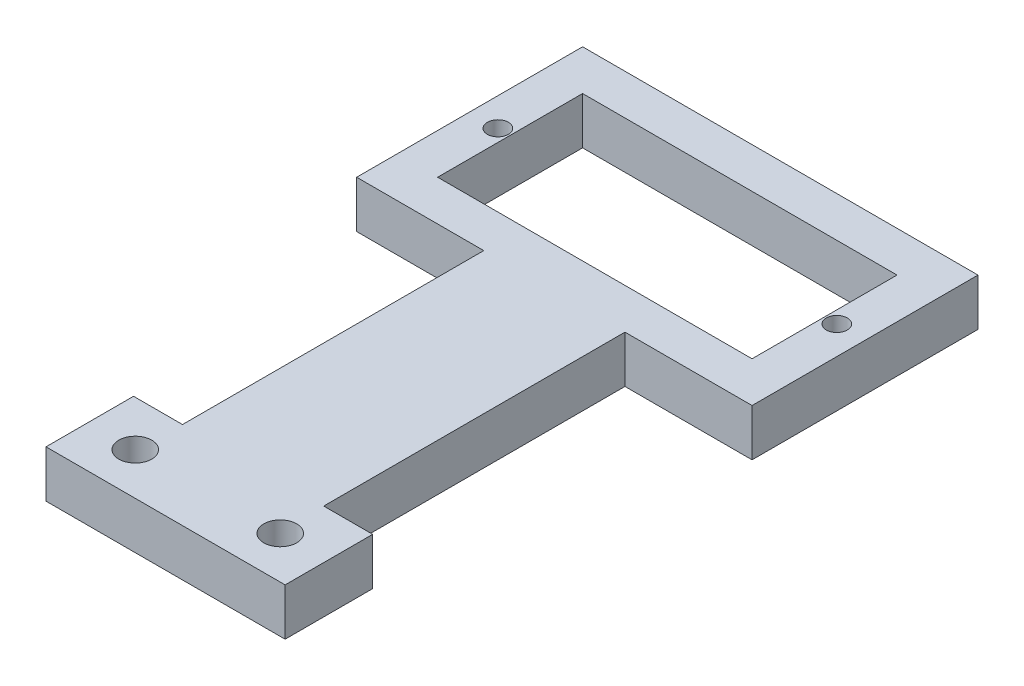
ISO-10303-21;
HEADER;
FILE_DESCRIPTION(('STEP AP214'),'2;1');
FILE_NAME('part.step','',(''),(''),'','','');
FILE_SCHEMA(('AUTOMOTIVE_DESIGN { 1 0 10303 214 1 1 1 1 }'));
ENDSEC;
DATA;
#1=APPLICATION_CONTEXT('core data for automotive mechanical design processes');
#2=APPLICATION_PROTOCOL_DEFINITION('international standard','automotive_design',2000,#1);
#3=PRODUCT_CONTEXT('',#1,'mechanical');
#4=PRODUCT('Part','Part','',(#3));
#5=PRODUCT_RELATED_PRODUCT_CATEGORY('part','',(#4));
#6=PRODUCT_DEFINITION_FORMATION('','',#4);
#7=PRODUCT_DEFINITION_CONTEXT('part definition',#1,'design');
#8=PRODUCT_DEFINITION('design','',#6,#7);
#9=PRODUCT_DEFINITION_SHAPE('','',#8);
#10=(LENGTH_UNIT() NAMED_UNIT(*) SI_UNIT(.MILLI.,.METRE.));
#11=(NAMED_UNIT(*) PLANE_ANGLE_UNIT() SI_UNIT($,.RADIAN.));
#12=(NAMED_UNIT(*) SI_UNIT($,.STERADIAN.) SOLID_ANGLE_UNIT());
#13=UNCERTAINTY_MEASURE_WITH_UNIT(LENGTH_MEASURE(1.E-05),#10,'distance_accuracy_value','');
#14=(GEOMETRIC_REPRESENTATION_CONTEXT(3) GLOBAL_UNCERTAINTY_ASSIGNED_CONTEXT((#13)) GLOBAL_UNIT_ASSIGNED_CONTEXT((#10,
#11,#12)) REPRESENTATION_CONTEXT('',''));
#15=CARTESIAN_POINT('',(0.,0.,0.));
#16=DIRECTION('',(0.,0.,1.));
#17=DIRECTION('',(1.,0.,0.));
#18=AXIS2_PLACEMENT_3D('',#15,#16,#17);
#19=CARTESIAN_POINT('',(0.,5.,0.));
#20=DIRECTION('',(0.,0.,-1.));
#21=DIRECTION('',(-1.,0.,0.));
#22=AXIS2_PLACEMENT_3D('',#19,#20,#21);
#23=PLANE('',#22);
#24=DIRECTION('',(0.,1.,0.));
#25=VECTOR('',#24,1.);
#26=CARTESIAN_POINT('',(28.5,-35.3411940941446,0.));
#27=LINE('',#26,#25);
#28=CARTESIAN_POINT('',(28.5,0.,0.));
#29=VERTEX_POINT('',#28);
#30=CARTESIAN_POINT('',(28.5,5.,0.));
#31=VERTEX_POINT('',#30);
#32=EDGE_CURVE('E216',#29,#31,#27,.T.);
#33=ORIENTED_EDGE('',*,*,#32,.F.);
#34=DIRECTION('',(1.,0.,0.));
#35=VECTOR('',#34,1.);
#36=CARTESIAN_POINT('',(0.,0.,0.));
#37=LINE('',#36,#35);
#38=CARTESIAN_POINT('',(42.,0.,0.));
#39=VERTEX_POINT('',#38);
#40=EDGE_CURVE('E294',#29,#39,#37,.T.);
#41=ORIENTED_EDGE('',*,*,#40,.T.);
#42=DIRECTION('',(0.,-1.,0.));
#43=VECTOR('',#42,1.);
#44=CARTESIAN_POINT('',(42.,5.,0.));
#45=LINE('',#44,#43);
#46=CARTESIAN_POINT('',(42.,5.,0.));
#47=VERTEX_POINT('',#46);
#48=EDGE_CURVE('E48',#47,#39,#45,.T.);
#49=ORIENTED_EDGE('',*,*,#48,.F.);
#50=DIRECTION('',(1.,0.,0.));
#51=VECTOR('',#50,1.);
#52=CARTESIAN_POINT('',(0.,5.,0.));
#53=LINE('',#52,#51);
#54=EDGE_CURVE('E278',#31,#47,#53,.T.);
#55=ORIENTED_EDGE('',*,*,#54,.F.);
#56=EDGE_LOOP('',(#33,#41,#49,#55));
#57=FACE_BOUND('',#56,.T.);
#58=ADVANCED_FACE('F39',(#57),#23,.F.);
#59=CARTESIAN_POINT('',(0.,5.,0.));
#60=DIRECTION('',(1.,0.,0.));
#61=DIRECTION('',(0.,0.,-1.));
#62=AXIS2_PLACEMENT_3D('',#59,#60,#61);
#63=PLANE('',#62);
#64=DIRECTION('',(0.,0.,1.));
#65=VECTOR('',#64,1.);
#66=CARTESIAN_POINT('',(0.,0.,0.));
#67=LINE('',#66,#65);
#68=CARTESIAN_POINT('',(0.,0.,-24.));
#69=VERTEX_POINT('',#68);
#70=CARTESIAN_POINT('',(0.,0.,0.));
#71=VERTEX_POINT('',#70);
#72=EDGE_CURVE('E265',#69,#71,#67,.T.);
#73=ORIENTED_EDGE('',*,*,#72,.T.);
#74=DIRECTION('',(0.,-1.,0.));
#75=VECTOR('',#74,1.);
#76=CARTESIAN_POINT('',(0.,5.,0.));
#77=LINE('',#76,#75);
#78=CARTESIAN_POINT('',(0.,5.,0.));
#79=VERTEX_POINT('',#78);
#80=EDGE_CURVE('E11',#79,#71,#77,.T.);
#81=ORIENTED_EDGE('',*,*,#80,.F.);
#82=DIRECTION('',(0.,0.,1.));
#83=VECTOR('',#82,1.);
#84=CARTESIAN_POINT('',(0.,5.,0.));
#85=LINE('',#84,#83);
#86=CARTESIAN_POINT('',(0.,5.,-24.));
#87=VERTEX_POINT('',#86);
#88=EDGE_CURVE('E274',#87,#79,#85,.T.);
#89=ORIENTED_EDGE('',*,*,#88,.F.);
#90=DIRECTION('',(0.,-1.,0.));
#91=VECTOR('',#90,1.);
#92=CARTESIAN_POINT('',(0.,5.,-24.));
#93=LINE('',#92,#91);
#94=EDGE_CURVE('E290',#87,#69,#93,.T.);
#95=ORIENTED_EDGE('',*,*,#94,.T.);
#96=EDGE_LOOP('',(#73,#81,#89,#95));
#97=FACE_BOUND('',#96,.T.);
#98=ADVANCED_FACE('F41',(#97),#63,.F.);
#99=CARTESIAN_POINT('',(13.5,0.,0.));
#100=VERTEX_POINT('',#99);
#101=EDGE_CURVE('E295',#71,#100,#37,.T.);
#102=ORIENTED_EDGE('',*,*,#101,.T.);
#103=DIRECTION('',(0.,1.,0.));
#104=VECTOR('',#103,1.);
#105=CARTESIAN_POINT('',(13.5,-35.3411940941446,0.));
#106=LINE('',#105,#104);
#107=CARTESIAN_POINT('',(13.5,5.,0.));
#108=VERTEX_POINT('',#107);
#109=EDGE_CURVE('E209',#100,#108,#106,.T.);
#110=ORIENTED_EDGE('',*,*,#109,.T.);
#111=EDGE_CURVE('E280',#79,#108,#53,.T.);
#112=ORIENTED_EDGE('',*,*,#111,.F.);
#113=ORIENTED_EDGE('',*,*,#80,.T.);
#114=EDGE_LOOP('',(#102,#110,#112,#113));
#115=FACE_BOUND('',#114,.T.);
#116=ADVANCED_FACE('F380',(#115),#23,.F.);
#117=CARTESIAN_POINT('',(42.,5.,0.));
#118=DIRECTION('',(-1.,0.,0.));
#119=DIRECTION('',(0.,0.,1.));
#120=AXIS2_PLACEMENT_3D('',#117,#118,#119);
#121=PLANE('',#120);
#122=DIRECTION('',(0.,0.,-1.));
#123=VECTOR('',#122,1.);
#124=CARTESIAN_POINT('',(42.,0.,0.));
#125=LINE('',#124,#123);
#126=CARTESIAN_POINT('',(42.,0.,-24.));
#127=VERTEX_POINT('',#126);
#128=EDGE_CURVE('E299',#39,#127,#125,.T.);
#129=ORIENTED_EDGE('',*,*,#128,.T.);
#130=DIRECTION('',(0.,-1.,0.));
#131=VECTOR('',#130,1.);
#132=CARTESIAN_POINT('',(42.,5.,-24.));
#133=LINE('',#132,#131);
#134=CARTESIAN_POINT('',(42.,5.,-24.));
#135=VERTEX_POINT('',#134);
#136=EDGE_CURVE('E307',#135,#127,#133,.T.);
#137=ORIENTED_EDGE('',*,*,#136,.F.);
#138=DIRECTION('',(0.,0.,-1.));
#139=VECTOR('',#138,1.);
#140=CARTESIAN_POINT('',(42.,5.,0.));
#141=LINE('',#140,#139);
#142=EDGE_CURVE('E284',#47,#135,#141,.T.);
#143=ORIENTED_EDGE('',*,*,#142,.F.);
#144=ORIENTED_EDGE('',*,*,#48,.T.);
#145=EDGE_LOOP('',(#129,#137,#143,#144));
#146=FACE_BOUND('',#145,.T.);
#147=ADVANCED_FACE('F316',(#146),#121,.F.);
#148=CARTESIAN_POINT('',(0.,5.,-24.));
#149=DIRECTION('',(0.,0.,1.));
#150=DIRECTION('',(1.,0.,0.));
#151=AXIS2_PLACEMENT_3D('',#148,#149,#150);
#152=PLANE('',#151);
#153=DIRECTION('',(-1.,0.,0.));
#154=VECTOR('',#153,1.);
#155=CARTESIAN_POINT('',(0.,0.,-24.));
#156=LINE('',#155,#154);
#157=EDGE_CURVE('E279',#127,#69,#156,.T.);
#158=ORIENTED_EDGE('',*,*,#157,.T.);
#159=ORIENTED_EDGE('',*,*,#94,.F.);
#160=DIRECTION('',(-1.,0.,0.));
#161=VECTOR('',#160,1.);
#162=CARTESIAN_POINT('',(0.,5.,-24.));
#163=LINE('',#162,#161);
#164=EDGE_CURVE('E287',#135,#87,#163,.T.);
#165=ORIENTED_EDGE('',*,*,#164,.F.);
#166=ORIENTED_EDGE('',*,*,#136,.T.);
#167=EDGE_LOOP('',(#158,#159,#165,#166));
#168=FACE_BOUND('',#167,.T.);
#169=ADVANCED_FACE('F324',(#168),#152,.F.);
#170=CARTESIAN_POINT('',(0.,5.,0.));
#171=DIRECTION('',(0.,-1.,0.));
#172=DIRECTION('',(0.,0.,-1.));
#173=AXIS2_PLACEMENT_3D('',#170,#171,#172);
#174=PLANE('',#173);
#175=CARTESIAN_POINT('',(3.,5.,-12.));
#176=DIRECTION('',(0.,1.,0.));
#177=DIRECTION('',(0.,0.,1.));
#178=AXIS2_PLACEMENT_3D('',#175,#176,#177);
#179=CIRCLE('',#178,1.115);
#180=CARTESIAN_POINT('',(3.,5.,-10.885));
#181=VERTEX_POINT('',#180);
#182=EDGE_CURVE('E558',#181,#181,#179,.T.);
#183=ORIENTED_EDGE('',*,*,#182,.F.);
#184=EDGE_LOOP('',(#183));
#185=FACE_BOUND('',#184,.T.);
#186=CARTESIAN_POINT('',(39.,5.,-12.));
#187=DIRECTION('',(0.,1.,0.));
#188=DIRECTION('',(0.,0.,1.));
#189=AXIS2_PLACEMENT_3D('',#186,#187,#188);
#190=CIRCLE('',#189,1.115);
#191=CARTESIAN_POINT('',(39.,5.,-10.885));
#192=VERTEX_POINT('',#191);
#193=EDGE_CURVE('E360',#192,#192,#190,.T.);
#194=ORIENTED_EDGE('',*,*,#193,.F.);
#195=EDGE_LOOP('',(#194));
#196=FACE_BOUND('',#195,.T.);
#197=CARTESIAN_POINT('',(13.3,5.,36.81777032));
#198=DIRECTION('',(0.,1.,0.));
#199=DIRECTION('',(0.,0.,1.));
#200=AXIS2_PLACEMENT_3D('',#197,#198,#199);
#201=CIRCLE('',#200,1.75);
#202=CARTESIAN_POINT('',(13.3,5.,38.56777032));
#203=VERTEX_POINT('',#202);
#204=EDGE_CURVE('E351',#203,#203,#201,.T.);
#205=ORIENTED_EDGE('',*,*,#204,.F.);
#206=EDGE_LOOP('',(#205));
#207=FACE_BOUND('',#206,.T.);
#208=CARTESIAN_POINT('',(28.7,5.,36.81777032));
#209=DIRECTION('',(0.,1.,0.));
#210=DIRECTION('',(0.,0.,1.));
#211=AXIS2_PLACEMENT_3D('',#208,#209,#210);
#212=CIRCLE('',#211,1.75);
#213=CARTESIAN_POINT('',(28.7,5.,38.56777032));
#214=VERTEX_POINT('',#213);
#215=EDGE_CURVE('E366',#214,#214,#212,.T.);
#216=ORIENTED_EDGE('',*,*,#215,.F.);
#217=EDGE_LOOP('',(#216));
#218=FACE_BOUND('',#217,.T.);
#219=DIRECTION('',(0.,0.,1.));
#220=VECTOR('',#219,1.);
#221=CARTESIAN_POINT('',(4.3,5.,-19.7));
#222=LINE('',#221,#220);
#223=CARTESIAN_POINT('',(4.3,5.,-19.7));
#224=VERTEX_POINT('',#223);
#225=CARTESIAN_POINT('',(4.3,5.,-4.3));
#226=VERTEX_POINT('',#225);
#227=EDGE_CURVE('E251',#224,#226,#222,.T.);
#228=ORIENTED_EDGE('',*,*,#227,.F.);
#229=DIRECTION('',(-1.,0.,0.));
#230=VECTOR('',#229,1.);
#231=CARTESIAN_POINT('',(37.7,5.,-19.7));
#232=LINE('',#231,#230);
#233=CARTESIAN_POINT('',(37.7,5.,-19.7));
#234=VERTEX_POINT('',#233);
#235=EDGE_CURVE('E63',#234,#224,#232,.T.);
#236=ORIENTED_EDGE('',*,*,#235,.F.);
#237=DIRECTION('',(0.,0.,-1.));
#238=VECTOR('',#237,1.);
#239=CARTESIAN_POINT('',(37.7,5.,-4.3));
#240=LINE('',#239,#238);
#241=CARTESIAN_POINT('',(37.7,5.,-4.3));
#242=VERTEX_POINT('',#241);
#243=EDGE_CURVE('E236',#242,#234,#240,.T.);
#244=ORIENTED_EDGE('',*,*,#243,.F.);
#245=DIRECTION('',(1.,0.,0.));
#246=VECTOR('',#245,1.);
#247=CARTESIAN_POINT('',(4.3,5.,-4.3));
#248=LINE('',#247,#246);
#249=EDGE_CURVE('E255',#226,#242,#248,.T.);
#250=ORIENTED_EDGE('',*,*,#249,.F.);
#251=EDGE_LOOP('',(#228,#236,#244,#250));
#252=FACE_BOUND('',#251,.T.);
#253=ORIENTED_EDGE('',*,*,#88,.T.);
#254=ORIENTED_EDGE('',*,*,#111,.T.);
#255=DIRECTION('',(0.,0.,1.));
#256=VECTOR('',#255,1.);
#257=CARTESIAN_POINT('',(13.5,5.,0.));
#258=LINE('',#257,#256);
#259=CARTESIAN_POINT('',(13.5,5.,32.));
#260=VERTEX_POINT('',#259);
#261=EDGE_CURVE('E55',#108,#260,#258,.T.);
#262=ORIENTED_EDGE('',*,*,#261,.T.);
#263=DIRECTION('',(-1.,0.,0.));
#264=VECTOR('',#263,1.);
#265=CARTESIAN_POINT('',(8.30000000000001,5.,32.));
#266=LINE('',#265,#264);
#267=CARTESIAN_POINT('',(8.30000000000001,5.,32.));
#268=VERTEX_POINT('',#267);
#269=EDGE_CURVE('E186',#260,#268,#266,.T.);
#270=ORIENTED_EDGE('',*,*,#269,.T.);
#271=DIRECTION('',(0.,0.,1.));
#272=VECTOR('',#271,1.);
#273=CARTESIAN_POINT('',(8.30000000000001,5.,32.));
#274=LINE('',#273,#272);
#275=CARTESIAN_POINT('',(8.30000000000001,5.,41.3));
#276=VERTEX_POINT('',#275);
#277=EDGE_CURVE('E190',#268,#276,#274,.T.);
#278=ORIENTED_EDGE('',*,*,#277,.T.);
#279=DIRECTION('',(1.,0.,0.));
#280=VECTOR('',#279,1.);
#281=CARTESIAN_POINT('',(8.30000000000001,5.,41.3));
#282=LINE('',#281,#280);
#283=CARTESIAN_POINT('',(33.7,5.,41.3));
#284=VERTEX_POINT('',#283);
#285=EDGE_CURVE('E346',#276,#284,#282,.T.);
#286=ORIENTED_EDGE('',*,*,#285,.T.);
#287=DIRECTION('',(0.,0.,-1.));
#288=VECTOR('',#287,1.);
#289=CARTESIAN_POINT('',(33.7,5.,32.));
#290=LINE('',#289,#288);
#291=CARTESIAN_POINT('',(33.7,5.,32.));
#292=VERTEX_POINT('',#291);
#293=EDGE_CURVE('E172',#284,#292,#290,.T.);
#294=ORIENTED_EDGE('',*,*,#293,.T.);
#295=CARTESIAN_POINT('',(28.5,5.,32.));
#296=VERTEX_POINT('',#295);
#297=EDGE_CURVE('E182',#292,#296,#266,.T.);
#298=ORIENTED_EDGE('',*,*,#297,.T.);
#299=DIRECTION('',(0.,0.,-1.));
#300=VECTOR('',#299,1.);
#301=CARTESIAN_POINT('',(28.5,5.,0.));
#302=LINE('',#301,#300);
#303=EDGE_CURVE('E206',#296,#31,#302,.T.);
#304=ORIENTED_EDGE('',*,*,#303,.T.);
#305=ORIENTED_EDGE('',*,*,#54,.T.);
#306=ORIENTED_EDGE('',*,*,#142,.T.);
#307=ORIENTED_EDGE('',*,*,#164,.T.);
#308=EDGE_LOOP('',(#253,#254,#262,#270,#278,#286,#294,#298,#304,#305,#306,#307));
#309=FACE_BOUND('',#308,.T.);
#310=ADVANCED_FACE('F330',(#185,#196,#207,#218,#252,#309),#174,.F.);
#311=CARTESIAN_POINT('',(0.,0.,0.));
#312=DIRECTION('',(0.,-1.,0.));
#313=DIRECTION('',(0.,0.,-1.));
#314=AXIS2_PLACEMENT_3D('',#311,#312,#313);
#315=PLANE('',#314);
#316=CARTESIAN_POINT('',(3.,0.,-12.));
#317=DIRECTION('',(0.,1.,0.));
#318=DIRECTION('',(0.,0.,1.));
#319=AXIS2_PLACEMENT_3D('',#316,#317,#318);
#320=CIRCLE('',#319,1.115);
#321=CARTESIAN_POINT('',(3.,0.,-10.885));
#322=VERTEX_POINT('',#321);
#323=EDGE_CURVE('E369',#322,#322,#320,.T.);
#324=ORIENTED_EDGE('',*,*,#323,.T.);
#325=EDGE_LOOP('',(#324));
#326=FACE_BOUND('',#325,.T.);
#327=CARTESIAN_POINT('',(39.,0.,-12.));
#328=DIRECTION('',(0.,1.,0.));
#329=DIRECTION('',(0.,0.,1.));
#330=AXIS2_PLACEMENT_3D('',#327,#328,#329);
#331=CIRCLE('',#330,1.115);
#332=CARTESIAN_POINT('',(39.,0.,-10.885));
#333=VERTEX_POINT('',#332);
#334=EDGE_CURVE('E560',#333,#333,#331,.T.);
#335=ORIENTED_EDGE('',*,*,#334,.T.);
#336=EDGE_LOOP('',(#335));
#337=FACE_BOUND('',#336,.T.);
#338=CARTESIAN_POINT('',(13.3,0.,36.81777032));
#339=DIRECTION('',(0.,1.,0.));
#340=DIRECTION('',(0.,0.,1.));
#341=AXIS2_PLACEMENT_3D('',#338,#339,#340);
#342=CIRCLE('',#341,1.75);
#343=CARTESIAN_POINT('',(13.3,0.,38.56777032));
#344=VERTEX_POINT('',#343);
#345=EDGE_CURVE('E347',#344,#344,#342,.T.);
#346=ORIENTED_EDGE('',*,*,#345,.T.);
#347=EDGE_LOOP('',(#346));
#348=FACE_BOUND('',#347,.T.);
#349=CARTESIAN_POINT('',(28.7,0.,36.81777032));
#350=DIRECTION('',(0.,1.,0.));
#351=DIRECTION('',(0.,0.,1.));
#352=AXIS2_PLACEMENT_3D('',#349,#350,#351);
#353=CIRCLE('',#352,1.75);
#354=CARTESIAN_POINT('',(28.7,0.,38.56777032));
#355=VERTEX_POINT('',#354);
#356=EDGE_CURVE('E357',#355,#355,#353,.T.);
#357=ORIENTED_EDGE('',*,*,#356,.T.);
#358=EDGE_LOOP('',(#357));
#359=FACE_BOUND('',#358,.T.);
#360=DIRECTION('',(-1.,0.,0.));
#361=VECTOR('',#360,1.);
#362=CARTESIAN_POINT('',(37.7,0.,-19.7));
#363=LINE('',#362,#361);
#364=CARTESIAN_POINT('',(37.7,0.,-19.7));
#365=VERTEX_POINT('',#364);
#366=CARTESIAN_POINT('',(4.3,0.,-19.7));
#367=VERTEX_POINT('',#366);
#368=EDGE_CURVE('E231',#365,#367,#363,.T.);
#369=ORIENTED_EDGE('',*,*,#368,.T.);
#370=DIRECTION('',(0.,0.,1.));
#371=VECTOR('',#370,1.);
#372=CARTESIAN_POINT('',(4.3,0.,-19.7));
#373=LINE('',#372,#371);
#374=CARTESIAN_POINT('',(4.3,0.,-4.3));
#375=VERTEX_POINT('',#374);
#376=EDGE_CURVE('E235',#367,#375,#373,.T.);
#377=ORIENTED_EDGE('',*,*,#376,.T.);
#378=DIRECTION('',(1.,0.,0.));
#379=VECTOR('',#378,1.);
#380=CARTESIAN_POINT('',(4.3,0.,-4.3));
#381=LINE('',#380,#379);
#382=CARTESIAN_POINT('',(37.7,0.,-4.3));
#383=VERTEX_POINT('',#382);
#384=EDGE_CURVE('E240',#375,#383,#381,.T.);
#385=ORIENTED_EDGE('',*,*,#384,.T.);
#386=DIRECTION('',(0.,0.,-1.));
#387=VECTOR('',#386,1.);
#388=CARTESIAN_POINT('',(37.7,0.,-4.3));
#389=LINE('',#388,#387);
#390=EDGE_CURVE('E244',#383,#365,#389,.T.);
#391=ORIENTED_EDGE('',*,*,#390,.T.);
#392=EDGE_LOOP('',(#369,#377,#385,#391));
#393=FACE_BOUND('',#392,.T.);
#394=ORIENTED_EDGE('',*,*,#72,.F.);
#395=ORIENTED_EDGE('',*,*,#157,.F.);
#396=ORIENTED_EDGE('',*,*,#128,.F.);
#397=ORIENTED_EDGE('',*,*,#40,.F.);
#398=DIRECTION('',(0.,0.,-1.));
#399=VECTOR('',#398,1.);
#400=CARTESIAN_POINT('',(28.5,0.,0.));
#401=LINE('',#400,#399);
#402=CARTESIAN_POINT('',(28.5,0.,32.));
#403=VERTEX_POINT('',#402);
#404=EDGE_CURVE('E213',#403,#29,#401,.T.);
#405=ORIENTED_EDGE('',*,*,#404,.F.);
#406=DIRECTION('',(-1.,0.,0.));
#407=VECTOR('',#406,1.);
#408=CARTESIAN_POINT('',(8.30000000000001,0.,32.));
#409=LINE('',#408,#407);
#410=CARTESIAN_POINT('',(33.7,0.,32.));
#411=VERTEX_POINT('',#410);
#412=EDGE_CURVE('E162',#411,#403,#409,.T.);
#413=ORIENTED_EDGE('',*,*,#412,.F.);
#414=DIRECTION('',(0.,0.,-1.));
#415=VECTOR('',#414,1.);
#416=CARTESIAN_POINT('',(33.7,0.,32.));
#417=LINE('',#416,#415);
#418=CARTESIAN_POINT('',(33.7,0.,41.3));
#419=VERTEX_POINT('',#418);
#420=EDGE_CURVE('E153',#419,#411,#417,.T.);
#421=ORIENTED_EDGE('',*,*,#420,.F.);
#422=DIRECTION('',(1.,0.,0.));
#423=VECTOR('',#422,1.);
#424=CARTESIAN_POINT('',(8.30000000000001,0.,41.3));
#425=LINE('',#424,#423);
#426=CARTESIAN_POINT('',(8.30000000000001,0.,41.3));
#427=VERTEX_POINT('',#426);
#428=EDGE_CURVE('E159',#427,#419,#425,.T.);
#429=ORIENTED_EDGE('',*,*,#428,.F.);
#430=DIRECTION('',(0.,0.,1.));
#431=VECTOR('',#430,1.);
#432=CARTESIAN_POINT('',(8.30000000000001,0.,32.));
#433=LINE('',#432,#431);
#434=CARTESIAN_POINT('',(8.30000000000001,0.,32.));
#435=VERTEX_POINT('',#434);
#436=EDGE_CURVE('E192',#435,#427,#433,.T.);
#437=ORIENTED_EDGE('',*,*,#436,.F.);
#438=CARTESIAN_POINT('',(13.5,0.,32.));
#439=VERTEX_POINT('',#438);
#440=EDGE_CURVE('E197',#439,#435,#409,.T.);
#441=ORIENTED_EDGE('',*,*,#440,.F.);
#442=DIRECTION('',(0.,0.,1.));
#443=VECTOR('',#442,1.);
#444=CARTESIAN_POINT('',(13.5,0.,0.));
#445=LINE('',#444,#443);
#446=EDGE_CURVE('E218',#100,#439,#445,.T.);
#447=ORIENTED_EDGE('',*,*,#446,.F.);
#448=ORIENTED_EDGE('',*,*,#101,.F.);
#449=EDGE_LOOP('',(#394,#395,#396,#397,#405,#413,#421,#429,#437,#441,#447,#448));
#450=FACE_BOUND('',#449,.T.);
#451=ADVANCED_FACE('F156',(#326,#337,#348,#359,#393,#450),#315,.T.);
#452=CARTESIAN_POINT('',(37.7,0.,-19.7));
#453=DIRECTION('',(0.,0.,-1.));
#454=DIRECTION('',(-1.,0.,0.));
#455=AXIS2_PLACEMENT_3D('',#452,#453,#454);
#456=PLANE('',#455);
#457=ORIENTED_EDGE('',*,*,#235,.T.);
#458=DIRECTION('',(0.,1.,0.));
#459=VECTOR('',#458,1.);
#460=CARTESIAN_POINT('',(4.3,0.,-19.7));
#461=LINE('',#460,#459);
#462=EDGE_CURVE('E248',#367,#224,#461,.T.);
#463=ORIENTED_EDGE('',*,*,#462,.F.);
#464=ORIENTED_EDGE('',*,*,#368,.F.);
#465=DIRECTION('',(0.,1.,0.));
#466=VECTOR('',#465,1.);
#467=CARTESIAN_POINT('',(37.7,0.,-19.7));
#468=LINE('',#467,#466);
#469=EDGE_CURVE('E262',#365,#234,#468,.T.);
#470=ORIENTED_EDGE('',*,*,#469,.T.);
#471=EDGE_LOOP('',(#457,#463,#464,#470));
#472=FACE_BOUND('',#471,.T.);
#473=ADVANCED_FACE('F407',(#472),#456,.F.);
#474=CARTESIAN_POINT('',(37.7,0.,-4.3));
#475=DIRECTION('',(1.,0.,0.));
#476=DIRECTION('',(0.,0.,-1.));
#477=AXIS2_PLACEMENT_3D('',#474,#475,#476);
#478=PLANE('',#477);
#479=ORIENTED_EDGE('',*,*,#243,.T.);
#480=ORIENTED_EDGE('',*,*,#469,.F.);
#481=ORIENTED_EDGE('',*,*,#390,.F.);
#482=DIRECTION('',(0.,1.,0.));
#483=VECTOR('',#482,1.);
#484=CARTESIAN_POINT('',(37.7,0.,-4.3));
#485=LINE('',#484,#483);
#486=EDGE_CURVE('E266',#383,#242,#485,.T.);
#487=ORIENTED_EDGE('',*,*,#486,.T.);
#488=EDGE_LOOP('',(#479,#480,#481,#487));
#489=FACE_BOUND('',#488,.T.);
#490=ADVANCED_FACE('F404',(#489),#478,.F.);
#491=CARTESIAN_POINT('',(4.3,0.,-4.3));
#492=DIRECTION('',(0.,0.,1.));
#493=DIRECTION('',(1.,0.,0.));
#494=AXIS2_PLACEMENT_3D('',#491,#492,#493);
#495=PLANE('',#494);
#496=ORIENTED_EDGE('',*,*,#249,.T.);
#497=ORIENTED_EDGE('',*,*,#486,.F.);
#498=ORIENTED_EDGE('',*,*,#384,.F.);
#499=DIRECTION('',(0.,1.,0.));
#500=VECTOR('',#499,1.);
#501=CARTESIAN_POINT('',(4.3,0.,-4.3));
#502=LINE('',#501,#500);
#503=EDGE_CURVE('E269',#375,#226,#502,.T.);
#504=ORIENTED_EDGE('',*,*,#503,.T.);
#505=EDGE_LOOP('',(#496,#497,#498,#504));
#506=FACE_BOUND('',#505,.T.);
#507=ADVANCED_FACE('F399',(#506),#495,.F.);
#508=CARTESIAN_POINT('',(4.3,0.,-19.7));
#509=DIRECTION('',(-1.,0.,0.));
#510=DIRECTION('',(0.,0.,1.));
#511=AXIS2_PLACEMENT_3D('',#508,#509,#510);
#512=PLANE('',#511);
#513=ORIENTED_EDGE('',*,*,#227,.T.);
#514=ORIENTED_EDGE('',*,*,#503,.F.);
#515=ORIENTED_EDGE('',*,*,#376,.F.);
#516=ORIENTED_EDGE('',*,*,#462,.T.);
#517=EDGE_LOOP('',(#513,#514,#515,#516));
#518=FACE_BOUND('',#517,.T.);
#519=ADVANCED_FACE('F392',(#518),#512,.F.);
#520=CARTESIAN_POINT('',(13.5,-35.3411940941446,0.));
#521=DIRECTION('',(-1.,0.,0.));
#522=DIRECTION('',(0.,0.,1.));
#523=AXIS2_PLACEMENT_3D('',#520,#521,#522);
#524=PLANE('',#523);
#525=ORIENTED_EDGE('',*,*,#109,.F.);
#526=ORIENTED_EDGE('',*,*,#446,.T.);
#527=DIRECTION('',(0.,1.,0.));
#528=VECTOR('',#527,1.);
#529=CARTESIAN_POINT('',(13.5,-35.3411940941446,32.));
#530=LINE('',#529,#528);
#531=EDGE_CURVE('E221',#439,#260,#530,.T.);
#532=ORIENTED_EDGE('',*,*,#531,.T.);
#533=ORIENTED_EDGE('',*,*,#261,.F.);
#534=EDGE_LOOP('',(#525,#526,#532,#533));
#535=FACE_BOUND('',#534,.T.);
#536=ADVANCED_FACE('F390',(#535),#524,.T.);
#537=CARTESIAN_POINT('',(28.5,-35.3411940941446,0.));
#538=DIRECTION('',(1.,0.,0.));
#539=DIRECTION('',(0.,0.,-1.));
#540=AXIS2_PLACEMENT_3D('',#537,#538,#539);
#541=PLANE('',#540);
#542=DIRECTION('',(0.,1.,0.));
#543=VECTOR('',#542,1.);
#544=CARTESIAN_POINT('',(28.5,-35.3411940941446,32.));
#545=LINE('',#544,#543);
#546=EDGE_CURVE('E217',#403,#296,#545,.T.);
#547=ORIENTED_EDGE('',*,*,#546,.F.);
#548=ORIENTED_EDGE('',*,*,#404,.T.);
#549=ORIENTED_EDGE('',*,*,#32,.T.);
#550=ORIENTED_EDGE('',*,*,#303,.F.);
#551=EDGE_LOOP('',(#547,#548,#549,#550));
#552=FACE_BOUND('',#551,.T.);
#553=ADVANCED_FACE('F378',(#552),#541,.T.);
#554=CARTESIAN_POINT('',(8.30000000000001,-27.0490295574536,32.));
#555=DIRECTION('',(0.,0.,-1.));
#556=DIRECTION('',(-1.,0.,0.));
#557=AXIS2_PLACEMENT_3D('',#554,#555,#556);
#558=PLANE('',#557);
#559=ORIENTED_EDGE('',*,*,#531,.F.);
#560=ORIENTED_EDGE('',*,*,#440,.T.);
#561=DIRECTION('',(0.,1.,0.));
#562=VECTOR('',#561,1.);
#563=CARTESIAN_POINT('',(8.30000000000001,-27.0490295574536,32.));
#564=LINE('',#563,#562);
#565=EDGE_CURVE('E195',#435,#268,#564,.T.);
#566=ORIENTED_EDGE('',*,*,#565,.T.);
#567=ORIENTED_EDGE('',*,*,#269,.F.);
#568=EDGE_LOOP('',(#559,#560,#566,#567));
#569=FACE_BOUND('',#568,.T.);
#570=ADVANCED_FACE('F338',(#569),#558,.T.);
#571=CARTESIAN_POINT('',(8.30000000000001,-27.0490295574536,41.3));
#572=DIRECTION('',(0.,0.,1.));
#573=DIRECTION('',(1.,0.,0.));
#574=AXIS2_PLACEMENT_3D('',#571,#572,#573);
#575=PLANE('',#574);
#576=DIRECTION('',(0.,1.,0.));
#577=VECTOR('',#576,1.);
#578=CARTESIAN_POINT('',(8.30000000000001,-27.0490295574536,41.3));
#579=LINE('',#578,#577);
#580=EDGE_CURVE('E180',#427,#276,#579,.T.);
#581=ORIENTED_EDGE('',*,*,#580,.F.);
#582=ORIENTED_EDGE('',*,*,#428,.T.);
#583=DIRECTION('',(0.,1.,0.));
#584=VECTOR('',#583,1.);
#585=CARTESIAN_POINT('',(33.7,-27.0490295574536,41.3));
#586=LINE('',#585,#584);
#587=EDGE_CURVE('E167',#419,#284,#586,.T.);
#588=ORIENTED_EDGE('',*,*,#587,.T.);
#589=ORIENTED_EDGE('',*,*,#285,.F.);
#590=EDGE_LOOP('',(#581,#582,#588,#589));
#591=FACE_BOUND('',#590,.T.);
#592=ADVANCED_FACE('F179',(#591),#575,.T.);
#593=CARTESIAN_POINT('',(33.7,-27.0490295574536,32.));
#594=DIRECTION('',(1.,0.,0.));
#595=DIRECTION('',(0.,0.,-1.));
#596=AXIS2_PLACEMENT_3D('',#593,#594,#595);
#597=PLANE('',#596);
#598=ORIENTED_EDGE('',*,*,#587,.F.);
#599=ORIENTED_EDGE('',*,*,#420,.T.);
#600=DIRECTION('',(0.,1.,0.));
#601=VECTOR('',#600,1.);
#602=CARTESIAN_POINT('',(33.7,-27.0490295574536,32.));
#603=LINE('',#602,#601);
#604=EDGE_CURVE('E166',#411,#292,#603,.T.);
#605=ORIENTED_EDGE('',*,*,#604,.T.);
#606=ORIENTED_EDGE('',*,*,#293,.F.);
#607=EDGE_LOOP('',(#598,#599,#605,#606));
#608=FACE_BOUND('',#607,.T.);
#609=ADVANCED_FACE('F170',(#608),#597,.T.);
#610=ORIENTED_EDGE('',*,*,#412,.T.);
#611=ORIENTED_EDGE('',*,*,#546,.T.);
#612=ORIENTED_EDGE('',*,*,#297,.F.);
#613=ORIENTED_EDGE('',*,*,#604,.F.);
#614=EDGE_LOOP('',(#610,#611,#612,#613));
#615=FACE_BOUND('',#614,.T.);
#616=ADVANCED_FACE('F375',(#615),#558,.T.);
#617=CARTESIAN_POINT('',(8.30000000000001,-27.0490295574536,32.));
#618=DIRECTION('',(-1.,0.,0.));
#619=DIRECTION('',(0.,0.,1.));
#620=AXIS2_PLACEMENT_3D('',#617,#618,#619);
#621=PLANE('',#620);
#622=ORIENTED_EDGE('',*,*,#565,.F.);
#623=ORIENTED_EDGE('',*,*,#436,.T.);
#624=ORIENTED_EDGE('',*,*,#580,.T.);
#625=ORIENTED_EDGE('',*,*,#277,.F.);
#626=EDGE_LOOP('',(#622,#623,#624,#625));
#627=FACE_BOUND('',#626,.T.);
#628=ADVANCED_FACE('F343',(#627),#621,.T.);
#629=CARTESIAN_POINT('',(28.7,0.,36.81777032));
#630=DIRECTION('',(0.,1.,0.));
#631=DIRECTION('',(0.,0.,1.));
#632=AXIS2_PLACEMENT_3D('',#629,#630,#631);
#633=CYLINDRICAL_SURFACE('',#632,1.75);
#634=ORIENTED_EDGE('',*,*,#356,.F.);
#635=EDGE_LOOP('',(#634));
#636=FACE_BOUND('',#635,.T.);
#637=ORIENTED_EDGE('',*,*,#215,.T.);
#638=EDGE_LOOP('',(#637));
#639=FACE_BOUND('',#638,.T.);
#640=ADVANCED_FACE('F512',(#636,#639),#633,.F.);
#641=CARTESIAN_POINT('',(13.3,0.,36.81777032));
#642=DIRECTION('',(0.,1.,0.));
#643=DIRECTION('',(0.,0.,1.));
#644=AXIS2_PLACEMENT_3D('',#641,#642,#643);
#645=CYLINDRICAL_SURFACE('',#644,1.75);
#646=ORIENTED_EDGE('',*,*,#345,.F.);
#647=EDGE_LOOP('',(#646));
#648=FACE_BOUND('',#647,.T.);
#649=ORIENTED_EDGE('',*,*,#204,.T.);
#650=EDGE_LOOP('',(#649));
#651=FACE_BOUND('',#650,.T.);
#652=ADVANCED_FACE('F520',(#648,#651),#645,.F.);
#653=CARTESIAN_POINT('',(39.,0.,-12.));
#654=DIRECTION('',(0.,1.,0.));
#655=DIRECTION('',(0.,0.,1.));
#656=AXIS2_PLACEMENT_3D('',#653,#654,#655);
#657=CYLINDRICAL_SURFACE('',#656,1.115);
#658=ORIENTED_EDGE('',*,*,#334,.F.);
#659=EDGE_LOOP('',(#658));
#660=FACE_BOUND('',#659,.T.);
#661=ORIENTED_EDGE('',*,*,#193,.T.);
#662=EDGE_LOOP('',(#661));
#663=FACE_BOUND('',#662,.T.);
#664=ADVANCED_FACE('F529',(#660,#663),#657,.F.);
#665=CARTESIAN_POINT('',(3.,0.,-12.));
#666=DIRECTION('',(0.,1.,0.));
#667=DIRECTION('',(0.,0.,1.));
#668=AXIS2_PLACEMENT_3D('',#665,#666,#667);
#669=CYLINDRICAL_SURFACE('',#668,1.115);
#670=ORIENTED_EDGE('',*,*,#323,.F.);
#671=EDGE_LOOP('',(#670));
#672=FACE_BOUND('',#671,.T.);
#673=ORIENTED_EDGE('',*,*,#182,.T.);
#674=EDGE_LOOP('',(#673));
#675=FACE_BOUND('',#674,.T.);
#676=ADVANCED_FACE('F539',(#672,#675),#669,.F.);
#677=CLOSED_SHELL('',(#58,#98,#116,#147,#169,#310,#451,#473,#490,#507,#519,#536,#553,#570,#592,
#609,#616,#628,#640,#652,#664,#676));
#678=MANIFOLD_SOLID_BREP('B2',#677);
#679=ADVANCED_BREP_SHAPE_REPRESENTATION('',(#18,#678),#14);
#680=SHAPE_DEFINITION_REPRESENTATION(#9,#679);
ENDSEC;
END-ISO-10303-21;
